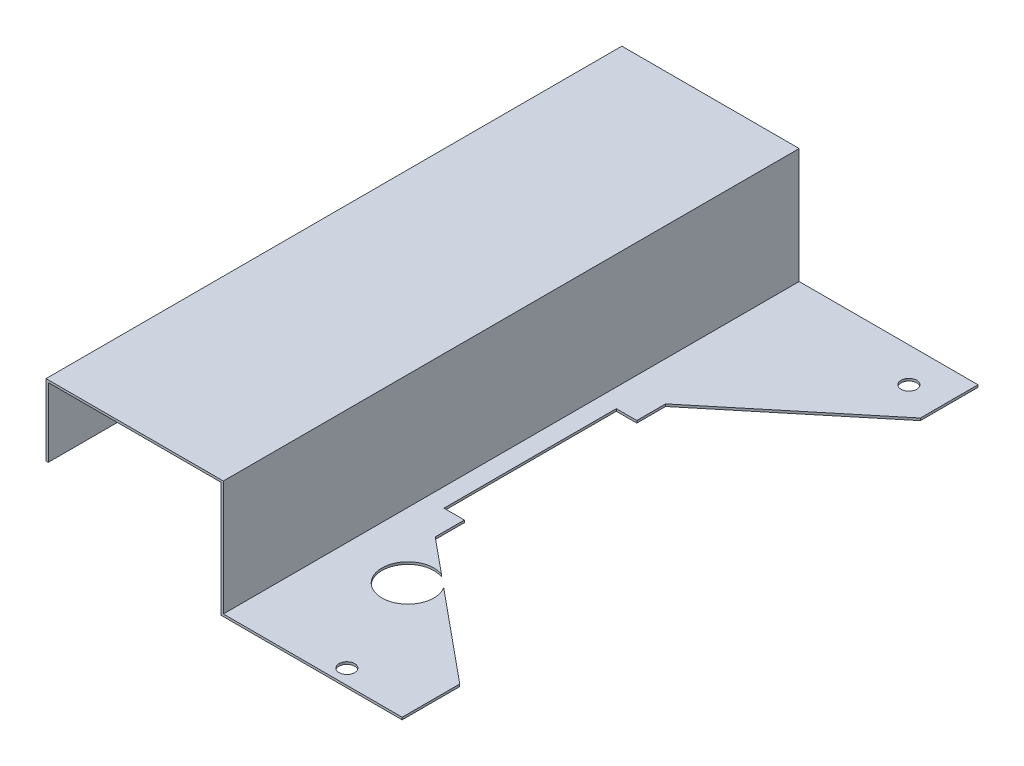
ISO-10303-21;
HEADER;
FILE_DESCRIPTION(('STEP AP214'),'2;1');
FILE_NAME('part.step','',(''),(''),'','','');
FILE_SCHEMA(('AUTOMOTIVE_DESIGN { 1 0 10303 214 1 1 1 1 }'));
ENDSEC;
DATA;
#1=APPLICATION_CONTEXT('core data for automotive mechanical design processes');
#2=APPLICATION_PROTOCOL_DEFINITION('international standard','automotive_design',2000,#1);
#3=PRODUCT_CONTEXT('',#1,'mechanical');
#4=PRODUCT('Part','Part','',(#3));
#5=PRODUCT_RELATED_PRODUCT_CATEGORY('part','',(#4));
#6=PRODUCT_DEFINITION_FORMATION('','',#4);
#7=PRODUCT_DEFINITION_CONTEXT('part definition',#1,'design');
#8=PRODUCT_DEFINITION('design','',#6,#7);
#9=PRODUCT_DEFINITION_SHAPE('','',#8);
#10=(LENGTH_UNIT() NAMED_UNIT(*) SI_UNIT(.MILLI.,.METRE.));
#11=(NAMED_UNIT(*) PLANE_ANGLE_UNIT() SI_UNIT($,.RADIAN.));
#12=(NAMED_UNIT(*) SI_UNIT($,.STERADIAN.) SOLID_ANGLE_UNIT());
#13=UNCERTAINTY_MEASURE_WITH_UNIT(LENGTH_MEASURE(1.E-05),#10,'distance_accuracy_value','');
#14=(GEOMETRIC_REPRESENTATION_CONTEXT(3) GLOBAL_UNCERTAINTY_ASSIGNED_CONTEXT((#13)) GLOBAL_UNIT_ASSIGNED_CONTEXT((#10,
#11,#12)) REPRESENTATION_CONTEXT('',''));
#15=CARTESIAN_POINT('',(0.,0.,0.));
#16=DIRECTION('',(0.,0.,1.));
#17=DIRECTION('',(1.,0.,0.));
#18=AXIS2_PLACEMENT_3D('',#15,#16,#17);
#19=CARTESIAN_POINT('',(79.8180528583146,-2.30000000000052,125.));
#20=DIRECTION('',(-1.,0.,0.));
#21=DIRECTION('',(0.,-1.,0.));
#22=AXIS2_PLACEMENT_3D('',#19,#20,#21);
#23=PLANE('',#22);
#24=DIRECTION('',(0.,-1.,0.));
#25=VECTOR('',#24,1.);
#26=CARTESIAN_POINT('',(79.8180528583146,-2.30000000000052,37.3429873518982));
#27=LINE('',#26,#25);
#28=CARTESIAN_POINT('',(79.8180528583146,-1.30000000000052,37.3429873518982));
#29=VERTEX_POINT('',#28);
#30=CARTESIAN_POINT('',(79.8180528583146,-2.30000000000052,37.3429873518982));
#31=VERTEX_POINT('',#30);
#32=EDGE_CURVE('E183',#29,#31,#27,.T.);
#33=ORIENTED_EDGE('',*,*,#32,.F.);
#34=DIRECTION('',(0.,0.,-1.));
#35=VECTOR('',#34,1.);
#36=CARTESIAN_POINT('',(79.8180528583146,-1.30000000000052,125.));
#37=LINE('',#36,#35);
#38=CARTESIAN_POINT('',(79.8180528583146,-1.30000000000052,50.));
#39=VERTEX_POINT('',#38);
#40=EDGE_CURVE('E315',#39,#29,#37,.T.);
#41=ORIENTED_EDGE('',*,*,#40,.F.);
#42=DIRECTION('',(0.,-1.,0.));
#43=VECTOR('',#42,1.);
#44=CARTESIAN_POINT('',(79.8180528583146,95.1406406117147,50.));
#45=LINE('',#44,#43);
#46=CARTESIAN_POINT('',(79.8180528583146,-2.30000000000052,50.));
#47=VERTEX_POINT('',#46);
#48=EDGE_CURVE('E255',#39,#47,#45,.T.);
#49=ORIENTED_EDGE('',*,*,#48,.T.);
#50=DIRECTION('',(0.,0.,-1.));
#51=VECTOR('',#50,1.);
#52=CARTESIAN_POINT('',(79.8180528583146,-2.30000000000052,125.));
#53=LINE('',#52,#51);
#54=EDGE_CURVE('E318',#47,#31,#53,.T.);
#55=ORIENTED_EDGE('',*,*,#54,.T.);
#56=EDGE_LOOP('',(#33,#41,#49,#55));
#57=FACE_BOUND('',#56,.T.);
#58=ADVANCED_FACE('F37',(#57),#23,.F.);
#59=CARTESIAN_POINT('',(7.7681065171597,95.1406406117147,-9.41935004810131));
#60=DIRECTION('',(-0.636243696362508,0.,0.771488145624399));
#61=DIRECTION('',(0.771488145624399,0.,0.636243696362508));
#62=AXIS2_PLACEMENT_3D('',#59,#60,#61);
#63=PLANE('',#62);
#64=DIRECTION('',(0.771488145624399,0.,0.636243696362508));
#65=VECTOR('',#64,1.);
#66=CARTESIAN_POINT('',(7.7681065171597,-1.30000000000054,-9.4193500481013));
#67=LINE('',#66,#65);
#68=CARTESIAN_POINT('',(95.2648680140729,-1.30000000000052,62.7389368553083));
#69=VERTEX_POINT('',#68);
#70=EDGE_CURVE('E243',#39,#69,#67,.T.);
#71=ORIENTED_EDGE('',*,*,#70,.T.);
#72=DIRECTION('',(0.,-1.,0.));
#73=VECTOR('',#72,1.);
#74=CARTESIAN_POINT('',(95.2648680140729,-1.30000000000052,62.7389368553083));
#75=LINE('',#74,#73);
#76=CARTESIAN_POINT('',(95.2648680140729,-2.30000000000052,62.7389368553083));
#77=VERTEX_POINT('',#76);
#78=EDGE_CURVE('E11',#69,#77,#75,.T.);
#79=ORIENTED_EDGE('',*,*,#78,.T.);
#80=DIRECTION('',(-0.771488145624399,0.,-0.636243696362508));
#81=VECTOR('',#80,1.);
#82=CARTESIAN_POINT('',(7.7681065171597,-2.30000000000052,-9.41935004810131));
#83=LINE('',#82,#81);
#84=EDGE_CURVE('E242',#77,#47,#83,.T.);
#85=ORIENTED_EDGE('',*,*,#84,.T.);
#86=ORIENTED_EDGE('',*,*,#48,.F.);
#87=EDGE_LOOP('',(#71,#79,#85,#86));
#88=FACE_BOUND('',#87,.T.);
#89=ADVANCED_FACE('F353',(#88),#63,.F.);
#90=CARTESIAN_POINT('',(61.8180528583146,-2.30000000000052,125.));
#91=DIRECTION('',(0.,1.,0.));
#92=DIRECTION('',(0.,0.,1.));
#93=AXIS2_PLACEMENT_3D('',#90,#91,#92);
#94=PLANE('',#93);
#95=CARTESIAN_POINT('',(79.8180528583146,-2.30000000000052,-37.4979309496583));
#96=VERTEX_POINT('',#95);
#97=CARTESIAN_POINT('',(79.8180528583146,-2.30000000000052,-50.));
#98=VERTEX_POINT('',#97);
#99=EDGE_CURVE('E317',#96,#98,#53,.T.);
#100=ORIENTED_EDGE('',*,*,#99,.F.);
#101=DIRECTION('',(1.,0.,0.));
#102=VECTOR('',#101,1.);
#103=CARTESIAN_POINT('',(70.918942863643,-2.30000000000052,-37.4979309496583));
#104=LINE('',#103,#102);
#105=CARTESIAN_POINT('',(70.918942863643,-2.30000000000052,-37.4979309496583));
#106=VERTEX_POINT('',#105);
#107=EDGE_CURVE('E200',#106,#96,#104,.T.);
#108=ORIENTED_EDGE('',*,*,#107,.F.);
#109=DIRECTION('',(0.,0.,1.));
#110=VECTOR('',#109,1.);
#111=CARTESIAN_POINT('',(70.918942863643,-2.30000000000052,-37.4979309496583));
#112=LINE('',#111,#110);
#113=CARTESIAN_POINT('',(70.918942863643,-2.30000000000052,37.3429873518982));
#114=VERTEX_POINT('',#113);
#115=EDGE_CURVE('E180',#106,#114,#112,.T.);
#116=ORIENTED_EDGE('',*,*,#115,.T.);
#117=DIRECTION('',(1.,0.,0.));
#118=VECTOR('',#117,1.);
#119=CARTESIAN_POINT('',(70.918942863643,-2.30000000000052,37.3429873518982));
#120=LINE('',#119,#118);
#121=EDGE_CURVE('E202',#114,#31,#120,.T.);
#122=ORIENTED_EDGE('',*,*,#121,.T.);
#123=ORIENTED_EDGE('',*,*,#54,.F.);
#124=ORIENTED_EDGE('',*,*,#84,.F.);
#125=CARTESIAN_POINT('',(91.2232624106757,-2.30000000000052,73.2786514135488));
#126=DIRECTION('',(0.,-1.,0.));
#127=DIRECTION('',(0.,0.,-1.));
#128=AXIS2_PLACEMENT_3D('',#125,#126,#127);
#129=CIRCLE('',#128,11.2880538102278);
#130=CARTESIAN_POINT('',(100.800721531511,-2.30000000000052,67.3043367573448));
#131=VERTEX_POINT('',#130);
#132=EDGE_CURVE('E208',#131,#77,#129,.T.);
#133=ORIENTED_EDGE('',*,*,#132,.F.);
#134=CARTESIAN_POINT('',(140.446405644763,-2.30000000000052,100.));
#135=VERTEX_POINT('',#134);
#136=EDGE_CURVE('E248',#135,#131,#83,.T.);
#137=ORIENTED_EDGE('',*,*,#136,.F.);
#138=DIRECTION('',(0.,0.,-1.));
#139=VECTOR('',#138,1.);
#140=CARTESIAN_POINT('',(140.446405644763,-2.30000000000052,0.));
#141=LINE('',#140,#139);
#142=CARTESIAN_POINT('',(140.446405644763,-2.30000000000052,125.));
#143=VERTEX_POINT('',#142);
#144=EDGE_CURVE('E251',#143,#135,#141,.T.);
#145=ORIENTED_EDGE('',*,*,#144,.F.);
#146=DIRECTION('',(1.,0.,0.));
#147=VECTOR('',#146,1.);
#148=CARTESIAN_POINT('',(61.8180528583146,-2.30000000000052,125.));
#149=LINE('',#148,#147);
#150=CARTESIAN_POINT('',(61.8180528583146,-2.30000000000052,125.));
#151=VERTEX_POINT('',#150);
#152=EDGE_CURVE('E275',#151,#143,#149,.T.);
#153=ORIENTED_EDGE('',*,*,#152,.F.);
#154=DIRECTION('',(0.,0.,-1.));
#155=VECTOR('',#154,1.);
#156=CARTESIAN_POINT('',(61.8180528583146,-2.30000000000052,125.));
#157=LINE('',#156,#155);
#158=CARTESIAN_POINT('',(61.8180528583146,-2.30000000000052,-125.));
#159=VERTEX_POINT('',#158);
#160=EDGE_CURVE('E321',#151,#159,#157,.T.);
#161=ORIENTED_EDGE('',*,*,#160,.T.);
#162=DIRECTION('',(1.,0.,0.));
#163=VECTOR('',#162,1.);
#164=CARTESIAN_POINT('',(61.8180528583146,-2.30000000000052,-125.));
#165=LINE('',#164,#163);
#166=CARTESIAN_POINT('',(140.446405644763,-2.30000000000052,-125.));
#167=VERTEX_POINT('',#166);
#168=EDGE_CURVE('E294',#159,#167,#165,.T.);
#169=ORIENTED_EDGE('',*,*,#168,.T.);
#170=DIRECTION('',(0.,0.,1.));
#171=VECTOR('',#170,1.);
#172=CARTESIAN_POINT('',(140.446405644763,-2.30000000000052,0.));
#173=LINE('',#172,#171);
#174=CARTESIAN_POINT('',(140.446405644763,-2.30000000000052,-100.));
#175=VERTEX_POINT('',#174);
#176=EDGE_CURVE('E223',#167,#175,#173,.T.);
#177=ORIENTED_EDGE('',*,*,#176,.T.);
#178=DIRECTION('',(-0.771488145624399,0.,0.636243696362508));
#179=VECTOR('',#178,1.);
#180=CARTESIAN_POINT('',(7.7681065171597,-2.30000000000052,9.41935004810131));
#181=LINE('',#180,#179);
#182=EDGE_CURVE('E231',#175,#98,#181,.T.);
#183=ORIENTED_EDGE('',*,*,#182,.T.);
#184=EDGE_LOOP('',(#100,#108,#116,#122,#123,#124,#133,#137,#145,#153,#161,#169,#177,#183));
#185=FACE_BOUND('',#184,.T.);
#186=CARTESIAN_POINT('',(109.974750596565,-2.30000000000052,118.548748506602));
#187=DIRECTION('',(0.,-1.,0.));
#188=DIRECTION('',(0.,0.,-1.));
#189=AXIS2_PLACEMENT_3D('',#186,#187,#188);
#190=CIRCLE('',#189,3.4);
#191=CARTESIAN_POINT('',(109.974750596565,-2.30000000000052,115.148748506602));
#192=VERTEX_POINT('',#191);
#193=EDGE_CURVE('E217',#192,#192,#190,.T.);
#194=ORIENTED_EDGE('',*,*,#193,.F.);
#195=EDGE_LOOP('',(#194));
#196=FACE_BOUND('',#195,.T.);
#197=CARTESIAN_POINT('',(125.446405644763,-2.30000000000052,-110.));
#198=DIRECTION('',(0.,-1.,0.));
#199=DIRECTION('',(0.,0.,-1.));
#200=AXIS2_PLACEMENT_3D('',#197,#198,#199);
#201=CIRCLE('',#200,3.39999999999999);
#202=CARTESIAN_POINT('',(125.446405644763,-2.30000000000052,-113.4));
#203=VERTEX_POINT('',#202);
#204=EDGE_CURVE('E210',#203,#203,#201,.T.);
#205=ORIENTED_EDGE('',*,*,#204,.F.);
#206=EDGE_LOOP('',(#205));
#207=FACE_BOUND('',#206,.T.);
#208=ADVANCED_FACE('F347',(#185,#196,#207),#94,.F.);
#209=CARTESIAN_POINT('',(-14.1819471416854,17.6999999999995,125.));
#210=DIRECTION('',(0.,1.,0.));
#211=DIRECTION('',(0.,0.,1.));
#212=AXIS2_PLACEMENT_3D('',#209,#210,#211);
#213=PLANE('',#212);
#214=DIRECTION('',(1.,0.,0.));
#215=VECTOR('',#214,1.);
#216=CARTESIAN_POINT('',(-14.1819471416854,17.6999999999995,-125.));
#217=LINE('',#216,#215);
#218=CARTESIAN_POINT('',(-14.1819471416854,17.6999999999995,-125.));
#219=VERTEX_POINT('',#218);
#220=CARTESIAN_POINT('',(-13.1819471416855,17.6999999999995,-125.));
#221=VERTEX_POINT('',#220);
#222=EDGE_CURVE('E246',#219,#221,#217,.T.);
#223=ORIENTED_EDGE('',*,*,#222,.T.);
#224=DIRECTION('',(0.,0.,-1.));
#225=VECTOR('',#224,1.);
#226=CARTESIAN_POINT('',(-13.1819471416855,17.6999999999995,125.));
#227=LINE('',#226,#225);
#228=CARTESIAN_POINT('',(-13.1819471416855,17.6999999999995,125.));
#229=VERTEX_POINT('',#228);
#230=EDGE_CURVE('E330',#229,#221,#227,.T.);
#231=ORIENTED_EDGE('',*,*,#230,.F.);
#232=DIRECTION('',(1.,0.,0.));
#233=VECTOR('',#232,1.);
#234=CARTESIAN_POINT('',(-14.1819471416854,17.6999999999995,125.));
#235=LINE('',#234,#233);
#236=CARTESIAN_POINT('',(-14.1819471416854,17.6999999999995,125.));
#237=VERTEX_POINT('',#236);
#238=EDGE_CURVE('E265',#237,#229,#235,.T.);
#239=ORIENTED_EDGE('',*,*,#238,.F.);
#240=DIRECTION('',(0.,0.,-1.));
#241=VECTOR('',#240,1.);
#242=CARTESIAN_POINT('',(-14.1819471416854,17.6999999999995,125.));
#243=LINE('',#242,#241);
#244=EDGE_CURVE('E285',#237,#219,#243,.T.);
#245=ORIENTED_EDGE('',*,*,#244,.T.);
#246=EDGE_LOOP('',(#223,#231,#239,#245));
#247=FACE_BOUND('',#246,.T.);
#248=ADVANCED_FACE('F39',(#247),#213,.F.);
#249=CARTESIAN_POINT('',(-13.1819471416855,17.6999999999995,125.));
#250=DIRECTION('',(-1.,0.,0.));
#251=DIRECTION('',(0.,-1.,0.));
#252=AXIS2_PLACEMENT_3D('',#249,#250,#251);
#253=PLANE('',#252);
#254=DIRECTION('',(0.,1.,0.));
#255=VECTOR('',#254,1.);
#256=CARTESIAN_POINT('',(-13.1819471416855,17.6999999999995,-125.));
#257=LINE('',#256,#255);
#258=CARTESIAN_POINT('',(-13.1819471416854,47.6999999999995,-125.));
#259=VERTEX_POINT('',#258);
#260=EDGE_CURVE('E288',#221,#259,#257,.T.);
#261=ORIENTED_EDGE('',*,*,#260,.T.);
#262=DIRECTION('',(0.,0.,-1.));
#263=VECTOR('',#262,1.);
#264=CARTESIAN_POINT('',(-13.1819471416854,47.6999999999995,125.));
#265=LINE('',#264,#263);
#266=CARTESIAN_POINT('',(-13.1819471416854,47.6999999999995,125.));
#267=VERTEX_POINT('',#266);
#268=EDGE_CURVE('E327',#267,#259,#265,.T.);
#269=ORIENTED_EDGE('',*,*,#268,.F.);
#270=DIRECTION('',(0.,1.,0.));
#271=VECTOR('',#270,1.);
#272=CARTESIAN_POINT('',(-13.1819471416855,17.6999999999995,125.));
#273=LINE('',#272,#271);
#274=EDGE_CURVE('E268',#229,#267,#273,.T.);
#275=ORIENTED_EDGE('',*,*,#274,.F.);
#276=ORIENTED_EDGE('',*,*,#230,.T.);
#277=EDGE_LOOP('',(#261,#269,#275,#276));
#278=FACE_BOUND('',#277,.T.);
#279=ADVANCED_FACE('F398',(#278),#253,.F.);
#280=CARTESIAN_POINT('',(-13.1819471416854,47.6999999999995,125.));
#281=DIRECTION('',(0.,1.,0.));
#282=DIRECTION('',(-1.,0.,0.));
#283=AXIS2_PLACEMENT_3D('',#280,#281,#282);
#284=PLANE('',#283);
#285=DIRECTION('',(1.,0.,0.));
#286=VECTOR('',#285,1.);
#287=CARTESIAN_POINT('',(-13.1819471416854,47.6999999999995,-125.));
#288=LINE('',#287,#286);
#289=CARTESIAN_POINT('',(61.8180528583146,47.6999999999995,-125.));
#290=VERTEX_POINT('',#289);
#291=EDGE_CURVE('E290',#259,#290,#288,.T.);
#292=ORIENTED_EDGE('',*,*,#291,.T.);
#293=DIRECTION('',(0.,0.,-1.));
#294=VECTOR('',#293,1.);
#295=CARTESIAN_POINT('',(61.8180528583146,47.6999999999995,125.));
#296=LINE('',#295,#294);
#297=CARTESIAN_POINT('',(61.8180528583146,47.6999999999995,125.));
#298=VERTEX_POINT('',#297);
#299=EDGE_CURVE('E324',#298,#290,#296,.T.);
#300=ORIENTED_EDGE('',*,*,#299,.F.);
#301=DIRECTION('',(1.,0.,0.));
#302=VECTOR('',#301,1.);
#303=CARTESIAN_POINT('',(-13.1819471416854,47.6999999999995,125.));
#304=LINE('',#303,#302);
#305=EDGE_CURVE('E271',#267,#298,#304,.T.);
#306=ORIENTED_EDGE('',*,*,#305,.F.);
#307=ORIENTED_EDGE('',*,*,#268,.T.);
#308=EDGE_LOOP('',(#292,#300,#306,#307));
#309=FACE_BOUND('',#308,.T.);
#310=ADVANCED_FACE('F395',(#309),#284,.F.);
#311=CARTESIAN_POINT('',(61.8180528583146,47.6999999999995,125.));
#312=DIRECTION('',(1.,0.,0.));
#313=DIRECTION('',(0.,1.,0.));
#314=AXIS2_PLACEMENT_3D('',#311,#312,#313);
#315=PLANE('',#314);
#316=DIRECTION('',(0.,-1.,0.));
#317=VECTOR('',#316,1.);
#318=CARTESIAN_POINT('',(61.8180528583146,47.6999999999995,-125.));
#319=LINE('',#318,#317);
#320=EDGE_CURVE('E292',#290,#159,#319,.T.);
#321=ORIENTED_EDGE('',*,*,#320,.T.);
#322=ORIENTED_EDGE('',*,*,#160,.F.);
#323=DIRECTION('',(0.,-1.,0.));
#324=VECTOR('',#323,1.);
#325=CARTESIAN_POINT('',(61.8180528583146,47.6999999999995,125.));
#326=LINE('',#325,#324);
#327=EDGE_CURVE('E273',#298,#151,#326,.T.);
#328=ORIENTED_EDGE('',*,*,#327,.F.);
#329=ORIENTED_EDGE('',*,*,#299,.T.);
#330=EDGE_LOOP('',(#321,#322,#328,#329));
#331=FACE_BOUND('',#330,.T.);
#332=ADVANCED_FACE('F392',(#331),#315,.F.);
#333=CARTESIAN_POINT('',(79.8180528583146,-1.30000000000052,-37.4979309496583));
#334=VERTEX_POINT('',#333);
#335=CARTESIAN_POINT('',(79.8180528583146,-1.30000000000052,-50.));
#336=VERTEX_POINT('',#335);
#337=EDGE_CURVE('E314',#334,#336,#37,.T.);
#338=ORIENTED_EDGE('',*,*,#337,.F.);
#339=DIRECTION('',(0.,-1.,0.));
#340=VECTOR('',#339,1.);
#341=CARTESIAN_POINT('',(79.8180528583146,-2.30000000000052,-37.4979309496583));
#342=LINE('',#341,#340);
#343=EDGE_CURVE('E189',#334,#96,#342,.T.);
#344=ORIENTED_EDGE('',*,*,#343,.T.);
#345=ORIENTED_EDGE('',*,*,#99,.T.);
#346=DIRECTION('',(0.,-1.,0.));
#347=VECTOR('',#346,1.);
#348=CARTESIAN_POINT('',(79.8180528583146,95.1406406117147,-50.));
#349=LINE('',#348,#347);
#350=EDGE_CURVE('E237',#336,#98,#349,.T.);
#351=ORIENTED_EDGE('',*,*,#350,.F.);
#352=EDGE_LOOP('',(#338,#344,#345,#351));
#353=FACE_BOUND('',#352,.T.);
#354=ADVANCED_FACE('F360',(#353),#23,.F.);
#355=CARTESIAN_POINT('',(79.8180528583146,-1.30000000000052,125.));
#356=DIRECTION('',(0.,-1.,0.));
#357=DIRECTION('',(1.,0.,0.));
#358=AXIS2_PLACEMENT_3D('',#355,#356,#357);
#359=PLANE('',#358);
#360=CARTESIAN_POINT('',(125.446405644763,-1.30000000000052,-110.));
#361=DIRECTION('',(0.,-1.,0.));
#362=DIRECTION('',(1.,0.,0.));
#363=AXIS2_PLACEMENT_3D('',#360,#361,#362);
#364=CIRCLE('',#363,3.39999999999999);
#365=CARTESIAN_POINT('',(128.846405644763,-1.30000000000052,-110.));
#366=VERTEX_POINT('',#365);
#367=EDGE_CURVE('E214',#366,#366,#364,.T.);
#368=ORIENTED_EDGE('',*,*,#367,.T.);
#369=EDGE_LOOP('',(#368));
#370=FACE_BOUND('',#369,.T.);
#371=CARTESIAN_POINT('',(109.974750596565,-1.30000000000052,118.548748506602));
#372=DIRECTION('',(0.,-1.,0.));
#373=DIRECTION('',(1.,0.,0.));
#374=AXIS2_PLACEMENT_3D('',#371,#372,#373);
#375=CIRCLE('',#374,3.39999999999999);
#376=CARTESIAN_POINT('',(113.374750596565,-1.30000000000052,118.548748506602));
#377=VERTEX_POINT('',#376);
#378=EDGE_CURVE('E220',#377,#377,#375,.T.);
#379=ORIENTED_EDGE('',*,*,#378,.T.);
#380=EDGE_LOOP('',(#379));
#381=FACE_BOUND('',#380,.T.);
#382=DIRECTION('',(0.,0.,1.));
#383=VECTOR('',#382,1.);
#384=CARTESIAN_POINT('',(70.918942863643,-1.30000000000052,-37.4979309496583));
#385=LINE('',#384,#383);
#386=CARTESIAN_POINT('',(70.918942863643,-1.30000000000052,-37.4979309496583));
#387=VERTEX_POINT('',#386);
#388=CARTESIAN_POINT('',(70.918942863643,-1.30000000000052,37.3429873518982));
#389=VERTEX_POINT('',#388);
#390=EDGE_CURVE('E177',#387,#389,#385,.T.);
#391=ORIENTED_EDGE('',*,*,#390,.F.);
#392=DIRECTION('',(1.,0.,0.));
#393=VECTOR('',#392,1.);
#394=CARTESIAN_POINT('',(70.918942863643,-1.30000000000052,-37.4979309496583));
#395=LINE('',#394,#393);
#396=EDGE_CURVE('E186',#387,#334,#395,.T.);
#397=ORIENTED_EDGE('',*,*,#396,.T.);
#398=ORIENTED_EDGE('',*,*,#337,.T.);
#399=DIRECTION('',(0.771488145624399,0.,-0.636243696362508));
#400=VECTOR('',#399,1.);
#401=CARTESIAN_POINT('',(7.7681065171597,-1.30000000000054,9.4193500481013));
#402=LINE('',#401,#400);
#403=CARTESIAN_POINT('',(140.446405644763,-1.30000000000052,-100.));
#404=VERTEX_POINT('',#403);
#405=EDGE_CURVE('E227',#336,#404,#402,.T.);
#406=ORIENTED_EDGE('',*,*,#405,.T.);
#407=DIRECTION('',(0.,0.,-1.));
#408=VECTOR('',#407,1.);
#409=CARTESIAN_POINT('',(140.446405644763,-1.30000000000051,0.));
#410=LINE('',#409,#408);
#411=CARTESIAN_POINT('',(140.446405644763,-1.30000000000052,-125.));
#412=VERTEX_POINT('',#411);
#413=EDGE_CURVE('E224',#404,#412,#410,.T.);
#414=ORIENTED_EDGE('',*,*,#413,.T.);
#415=DIRECTION('',(-1.,0.,0.));
#416=VECTOR('',#415,1.);
#417=CARTESIAN_POINT('',(79.8180528583146,-1.30000000000052,-125.));
#418=LINE('',#417,#416);
#419=CARTESIAN_POINT('',(62.8180528583146,-1.30000000000053,-125.));
#420=VERTEX_POINT('',#419);
#421=EDGE_CURVE('E296',#412,#420,#418,.T.);
#422=ORIENTED_EDGE('',*,*,#421,.T.);
#423=DIRECTION('',(0.,0.,-1.));
#424=VECTOR('',#423,1.);
#425=CARTESIAN_POINT('',(62.8180528583146,-1.30000000000053,125.));
#426=LINE('',#425,#424);
#427=CARTESIAN_POINT('',(62.8180528583146,-1.30000000000053,125.));
#428=VERTEX_POINT('',#427);
#429=EDGE_CURVE('E311',#428,#420,#426,.T.);
#430=ORIENTED_EDGE('',*,*,#429,.F.);
#431=DIRECTION('',(-1.,0.,0.));
#432=VECTOR('',#431,1.);
#433=CARTESIAN_POINT('',(79.8180528583146,-1.30000000000052,125.));
#434=LINE('',#433,#432);
#435=CARTESIAN_POINT('',(140.446405644763,-1.30000000000051,125.));
#436=VERTEX_POINT('',#435);
#437=EDGE_CURVE('E277',#436,#428,#434,.T.);
#438=ORIENTED_EDGE('',*,*,#437,.F.);
#439=DIRECTION('',(0.,0.,1.));
#440=VECTOR('',#439,1.);
#441=CARTESIAN_POINT('',(140.446405644763,-1.30000000000051,0.));
#442=LINE('',#441,#440);
#443=CARTESIAN_POINT('',(140.446405644763,-1.30000000000051,100.));
#444=VERTEX_POINT('',#443);
#445=EDGE_CURVE('E258',#444,#436,#442,.T.);
#446=ORIENTED_EDGE('',*,*,#445,.F.);
#447=CARTESIAN_POINT('',(100.800721531511,-1.30000000000052,67.3043367573448));
#448=VERTEX_POINT('',#447);
#449=EDGE_CURVE('E247',#448,#444,#67,.T.);
#450=ORIENTED_EDGE('',*,*,#449,.F.);
#451=CARTESIAN_POINT('',(91.2232624106757,-1.30000000000052,73.2786514135488));
#452=DIRECTION('',(0.,-1.,0.));
#453=DIRECTION('',(0.,0.,-1.));
#454=AXIS2_PLACEMENT_3D('',#451,#452,#453);
#455=CIRCLE('',#454,11.2880538102278);
#456=EDGE_CURVE('E60',#448,#69,#455,.T.);
#457=ORIENTED_EDGE('',*,*,#456,.T.);
#458=ORIENTED_EDGE('',*,*,#70,.F.);
#459=ORIENTED_EDGE('',*,*,#40,.T.);
#460=DIRECTION('',(1.,0.,0.));
#461=VECTOR('',#460,1.);
#462=CARTESIAN_POINT('',(70.918942863643,-1.30000000000052,37.3429873518982));
#463=LINE('',#462,#461);
#464=EDGE_CURVE('E192',#389,#29,#463,.T.);
#465=ORIENTED_EDGE('',*,*,#464,.F.);
#466=EDGE_LOOP('',(#391,#397,#398,#406,#414,#422,#430,#438,#446,#450,#457,#458,#459,#465));
#467=FACE_BOUND('',#466,.T.);
#468=ADVANCED_FACE('F194',(#370,#381,#467),#359,.F.);
#469=CARTESIAN_POINT('',(62.8180528583146,-1.30000000000053,125.));
#470=DIRECTION('',(-1.,0.,0.));
#471=DIRECTION('',(0.,0.,1.));
#472=AXIS2_PLACEMENT_3D('',#469,#470,#471);
#473=PLANE('',#472);
#474=DIRECTION('',(0.,1.,0.));
#475=VECTOR('',#474,1.);
#476=CARTESIAN_POINT('',(62.8180528583146,-1.30000000000053,-125.));
#477=LINE('',#476,#475);
#478=CARTESIAN_POINT('',(62.8180528583146,48.6999999999995,-125.));
#479=VERTEX_POINT('',#478);
#480=EDGE_CURVE('E298',#420,#479,#477,.T.);
#481=ORIENTED_EDGE('',*,*,#480,.T.);
#482=DIRECTION('',(0.,0.,-1.));
#483=VECTOR('',#482,1.);
#484=CARTESIAN_POINT('',(62.8180528583146,48.6999999999995,125.));
#485=LINE('',#484,#483);
#486=CARTESIAN_POINT('',(62.8180528583146,48.6999999999995,125.));
#487=VERTEX_POINT('',#486);
#488=EDGE_CURVE('E308',#487,#479,#485,.T.);
#489=ORIENTED_EDGE('',*,*,#488,.F.);
#490=DIRECTION('',(0.,1.,0.));
#491=VECTOR('',#490,1.);
#492=CARTESIAN_POINT('',(62.8180528583146,-1.30000000000053,125.));
#493=LINE('',#492,#491);
#494=EDGE_CURVE('E279',#428,#487,#493,.T.);
#495=ORIENTED_EDGE('',*,*,#494,.F.);
#496=ORIENTED_EDGE('',*,*,#429,.T.);
#497=EDGE_LOOP('',(#481,#489,#495,#496));
#498=FACE_BOUND('',#497,.T.);
#499=ADVANCED_FACE('F382',(#498),#473,.F.);
#500=CARTESIAN_POINT('',(62.8180528583146,48.6999999999995,125.));
#501=DIRECTION('',(0.,-1.,0.));
#502=DIRECTION('',(1.,0.,0.));
#503=AXIS2_PLACEMENT_3D('',#500,#501,#502);
#504=PLANE('',#503);
#505=DIRECTION('',(-1.,0.,0.));
#506=VECTOR('',#505,1.);
#507=CARTESIAN_POINT('',(62.8180528583146,48.6999999999995,-125.));
#508=LINE('',#507,#506);
#509=CARTESIAN_POINT('',(-14.1819471416855,48.6999999999995,-125.));
#510=VERTEX_POINT('',#509);
#511=EDGE_CURVE('E300',#479,#510,#508,.T.);
#512=ORIENTED_EDGE('',*,*,#511,.T.);
#513=DIRECTION('',(0.,0.,-1.));
#514=VECTOR('',#513,1.);
#515=CARTESIAN_POINT('',(-14.1819471416855,48.6999999999995,125.));
#516=LINE('',#515,#514);
#517=CARTESIAN_POINT('',(-14.1819471416855,48.6999999999995,125.));
#518=VERTEX_POINT('',#517);
#519=EDGE_CURVE('E305',#518,#510,#516,.T.);
#520=ORIENTED_EDGE('',*,*,#519,.F.);
#521=DIRECTION('',(-1.,0.,0.));
#522=VECTOR('',#521,1.);
#523=CARTESIAN_POINT('',(62.8180528583146,48.6999999999995,125.));
#524=LINE('',#523,#522);
#525=EDGE_CURVE('E281',#487,#518,#524,.T.);
#526=ORIENTED_EDGE('',*,*,#525,.F.);
#527=ORIENTED_EDGE('',*,*,#488,.T.);
#528=EDGE_LOOP('',(#512,#520,#526,#527));
#529=FACE_BOUND('',#528,.T.);
#530=ADVANCED_FACE('F408',(#529),#504,.F.);
#531=CARTESIAN_POINT('',(-14.1819471416855,48.6999999999995,125.));
#532=DIRECTION('',(1.,0.,0.));
#533=DIRECTION('',(0.,1.,0.));
#534=AXIS2_PLACEMENT_3D('',#531,#532,#533);
#535=PLANE('',#534);
#536=DIRECTION('',(0.,-1.,0.));
#537=VECTOR('',#536,1.);
#538=CARTESIAN_POINT('',(-14.1819471416855,48.6999999999995,-125.));
#539=LINE('',#538,#537);
#540=EDGE_CURVE('E269',#510,#219,#539,.T.);
#541=ORIENTED_EDGE('',*,*,#540,.T.);
#542=ORIENTED_EDGE('',*,*,#244,.F.);
#543=DIRECTION('',(0.,-1.,0.));
#544=VECTOR('',#543,1.);
#545=CARTESIAN_POINT('',(-14.1819471416855,48.6999999999995,125.));
#546=LINE('',#545,#544);
#547=EDGE_CURVE('E283',#518,#237,#546,.T.);
#548=ORIENTED_EDGE('',*,*,#547,.F.);
#549=ORIENTED_EDGE('',*,*,#519,.T.);
#550=EDGE_LOOP('',(#541,#542,#548,#549));
#551=FACE_BOUND('',#550,.T.);
#552=ADVANCED_FACE('F405',(#551),#535,.F.);
#553=CARTESIAN_POINT('',(0.,0.,125.));
#554=DIRECTION('',(0.,0.,1.));
#555=DIRECTION('',(1.,0.,0.));
#556=AXIS2_PLACEMENT_3D('',#553,#554,#555);
#557=PLANE('',#556);
#558=ORIENTED_EDGE('',*,*,#238,.T.);
#559=ORIENTED_EDGE('',*,*,#274,.T.);
#560=ORIENTED_EDGE('',*,*,#305,.T.);
#561=ORIENTED_EDGE('',*,*,#327,.T.);
#562=ORIENTED_EDGE('',*,*,#152,.T.);
#563=DIRECTION('',(0.,-1.,0.));
#564=VECTOR('',#563,1.);
#565=CARTESIAN_POINT('',(140.446405644763,95.1406406117147,125.));
#566=LINE('',#565,#564);
#567=EDGE_CURVE('E259',#436,#143,#566,.T.);
#568=ORIENTED_EDGE('',*,*,#567,.F.);
#569=ORIENTED_EDGE('',*,*,#437,.T.);
#570=ORIENTED_EDGE('',*,*,#494,.T.);
#571=ORIENTED_EDGE('',*,*,#525,.T.);
#572=ORIENTED_EDGE('',*,*,#547,.T.);
#573=EDGE_LOOP('',(#558,#559,#560,#561,#562,#568,#569,#570,#571,#572));
#574=FACE_BOUND('',#573,.T.);
#575=ADVANCED_FACE('F386',(#574),#557,.T.);
#576=CARTESIAN_POINT('',(0.,0.,-125.));
#577=DIRECTION('',(0.,0.,1.));
#578=DIRECTION('',(1.,0.,0.));
#579=AXIS2_PLACEMENT_3D('',#576,#577,#578);
#580=PLANE('',#579);
#581=ORIENTED_EDGE('',*,*,#222,.F.);
#582=ORIENTED_EDGE('',*,*,#540,.F.);
#583=ORIENTED_EDGE('',*,*,#511,.F.);
#584=ORIENTED_EDGE('',*,*,#480,.F.);
#585=ORIENTED_EDGE('',*,*,#421,.F.);
#586=DIRECTION('',(0.,-1.,0.));
#587=VECTOR('',#586,1.);
#588=CARTESIAN_POINT('',(140.446405644763,95.1406406117147,-125.));
#589=LINE('',#588,#587);
#590=EDGE_CURVE('E228',#412,#167,#589,.T.);
#591=ORIENTED_EDGE('',*,*,#590,.T.);
#592=ORIENTED_EDGE('',*,*,#168,.F.);
#593=ORIENTED_EDGE('',*,*,#320,.F.);
#594=ORIENTED_EDGE('',*,*,#291,.F.);
#595=ORIENTED_EDGE('',*,*,#260,.F.);
#596=EDGE_LOOP('',(#581,#582,#583,#584,#585,#591,#592,#593,#594,#595));
#597=FACE_BOUND('',#596,.T.);
#598=ADVANCED_FACE('F377',(#597),#580,.F.);
#599=CARTESIAN_POINT('',(140.446405644763,95.1406406117147,0.));
#600=DIRECTION('',(-1.,0.,0.));
#601=DIRECTION('',(0.,0.,1.));
#602=AXIS2_PLACEMENT_3D('',#599,#600,#601);
#603=PLANE('',#602);
#604=DIRECTION('',(0.,-1.,0.));
#605=VECTOR('',#604,1.);
#606=CARTESIAN_POINT('',(140.446405644763,95.1406406117147,100.));
#607=LINE('',#606,#605);
#608=EDGE_CURVE('E254',#444,#135,#607,.T.);
#609=ORIENTED_EDGE('',*,*,#608,.F.);
#610=ORIENTED_EDGE('',*,*,#445,.T.);
#611=ORIENTED_EDGE('',*,*,#567,.T.);
#612=ORIENTED_EDGE('',*,*,#144,.T.);
#613=EDGE_LOOP('',(#609,#610,#611,#612));
#614=FACE_BOUND('',#613,.T.);
#615=ADVANCED_FACE('F342',(#614),#603,.F.);
#616=ORIENTED_EDGE('',*,*,#136,.T.);
#617=DIRECTION('',(0.,-1.,0.));
#618=VECTOR('',#617,1.);
#619=CARTESIAN_POINT('',(100.800721531511,-1.30000000000052,67.3043367573448));
#620=LINE('',#619,#618);
#621=EDGE_CURVE('E45',#131,#448,#620,.F.);
#622=ORIENTED_EDGE('',*,*,#621,.T.);
#623=ORIENTED_EDGE('',*,*,#449,.T.);
#624=ORIENTED_EDGE('',*,*,#608,.T.);
#625=EDGE_LOOP('',(#616,#622,#623,#624));
#626=FACE_BOUND('',#625,.T.);
#627=ADVANCED_FACE('F334',(#626),#63,.F.);
#628=CARTESIAN_POINT('',(140.446405644763,95.1406406117147,0.));
#629=DIRECTION('',(1.,0.,0.));
#630=DIRECTION('',(0.,0.,-1.));
#631=AXIS2_PLACEMENT_3D('',#628,#629,#630);
#632=PLANE('',#631);
#633=ORIENTED_EDGE('',*,*,#413,.F.);
#634=DIRECTION('',(0.,-1.,0.));
#635=VECTOR('',#634,1.);
#636=CARTESIAN_POINT('',(140.446405644763,95.1406406117147,-100.));
#637=LINE('',#636,#635);
#638=EDGE_CURVE('E234',#404,#175,#637,.T.);
#639=ORIENTED_EDGE('',*,*,#638,.T.);
#640=ORIENTED_EDGE('',*,*,#176,.F.);
#641=ORIENTED_EDGE('',*,*,#590,.F.);
#642=EDGE_LOOP('',(#633,#639,#640,#641));
#643=FACE_BOUND('',#642,.T.);
#644=ADVANCED_FACE('F368',(#643),#632,.T.);
#645=CARTESIAN_POINT('',(7.7681065171597,95.1406406117147,9.41935004810131));
#646=DIRECTION('',(0.636243696362508,0.,0.771488145624399));
#647=DIRECTION('',(0.771488145624399,0.,-0.636243696362508));
#648=AXIS2_PLACEMENT_3D('',#645,#646,#647);
#649=PLANE('',#648);
#650=ORIENTED_EDGE('',*,*,#405,.F.);
#651=ORIENTED_EDGE('',*,*,#350,.T.);
#652=ORIENTED_EDGE('',*,*,#182,.F.);
#653=ORIENTED_EDGE('',*,*,#638,.F.);
#654=EDGE_LOOP('',(#650,#651,#652,#653));
#655=FACE_BOUND('',#654,.T.);
#656=ADVANCED_FACE('F371',(#655),#649,.T.);
#657=CARTESIAN_POINT('',(109.974750596565,-2.30000000000052,118.548748506602));
#658=DIRECTION('',(0.,-1.,0.));
#659=DIRECTION('',(0.,0.,-1.));
#660=AXIS2_PLACEMENT_3D('',#657,#658,#659);
#661=CYLINDRICAL_SURFACE('',#660,3.39999999999999);
#662=ORIENTED_EDGE('',*,*,#193,.T.);
#663=EDGE_LOOP('',(#662));
#664=FACE_BOUND('',#663,.T.);
#665=ORIENTED_EDGE('',*,*,#378,.F.);
#666=EDGE_LOOP('',(#665));
#667=FACE_BOUND('',#666,.T.);
#668=ADVANCED_FACE('F509',(#664,#667),#661,.F.);
#669=CARTESIAN_POINT('',(125.446405644763,-2.30000000000052,-110.));
#670=DIRECTION('',(0.,-1.,0.));
#671=DIRECTION('',(0.,0.,-1.));
#672=AXIS2_PLACEMENT_3D('',#669,#670,#671);
#673=CYLINDRICAL_SURFACE('',#672,3.39999999999999);
#674=ORIENTED_EDGE('',*,*,#204,.T.);
#675=EDGE_LOOP('',(#674));
#676=FACE_BOUND('',#675,.T.);
#677=ORIENTED_EDGE('',*,*,#367,.F.);
#678=EDGE_LOOP('',(#677));
#679=FACE_BOUND('',#678,.T.);
#680=ADVANCED_FACE('F457',(#676,#679),#673,.F.);
#681=CARTESIAN_POINT('',(91.2232624106757,-1.30000000000052,73.2786514135488));
#682=DIRECTION('',(0.,-1.,0.));
#683=DIRECTION('',(0.,0.,-1.));
#684=AXIS2_PLACEMENT_3D('',#681,#682,#683);
#685=CYLINDRICAL_SURFACE('',#684,11.2880538102278);
#686=ORIENTED_EDGE('',*,*,#456,.F.);
#687=ORIENTED_EDGE('',*,*,#621,.F.);
#688=ORIENTED_EDGE('',*,*,#132,.T.);
#689=ORIENTED_EDGE('',*,*,#78,.F.);
#690=EDGE_LOOP('',(#686,#687,#688,#689));
#691=FACE_BOUND('',#690,.T.);
#692=ADVANCED_FACE('F351',(#691),#685,.F.);
#693=CARTESIAN_POINT('',(70.918942863643,-1.30000000000052,-37.4979309496583));
#694=DIRECTION('',(0.,0.,-1.));
#695=DIRECTION('',(-1.,0.,0.));
#696=AXIS2_PLACEMENT_3D('',#693,#694,#695);
#697=PLANE('',#696);
#698=ORIENTED_EDGE('',*,*,#396,.F.);
#699=DIRECTION('',(0.,-1.,0.));
#700=VECTOR('',#699,1.);
#701=CARTESIAN_POINT('',(70.918942863643,-1.30000000000052,-37.4979309496583));
#702=LINE('',#701,#700);
#703=EDGE_CURVE('E173',#387,#106,#702,.T.);
#704=ORIENTED_EDGE('',*,*,#703,.T.);
#705=ORIENTED_EDGE('',*,*,#107,.T.);
#706=ORIENTED_EDGE('',*,*,#343,.F.);
#707=EDGE_LOOP('',(#698,#704,#705,#706));
#708=FACE_BOUND('',#707,.T.);
#709=ADVANCED_FACE('F187',(#708),#697,.F.);
#710=CARTESIAN_POINT('',(70.918942863643,-1.30000000000052,37.3429873518982));
#711=DIRECTION('',(0.,0.,-1.));
#712=DIRECTION('',(-1.,0.,0.));
#713=AXIS2_PLACEMENT_3D('',#710,#711,#712);
#714=PLANE('',#713);
#715=ORIENTED_EDGE('',*,*,#32,.T.);
#716=ORIENTED_EDGE('',*,*,#121,.F.);
#717=DIRECTION('',(0.,-1.,0.));
#718=VECTOR('',#717,1.);
#719=CARTESIAN_POINT('',(70.918942863643,-1.30000000000052,37.3429873518982));
#720=LINE('',#719,#718);
#721=EDGE_CURVE('E52',#389,#114,#720,.T.);
#722=ORIENTED_EDGE('',*,*,#721,.F.);
#723=ORIENTED_EDGE('',*,*,#464,.T.);
#724=EDGE_LOOP('',(#715,#716,#722,#723));
#725=FACE_BOUND('',#724,.T.);
#726=ADVANCED_FACE('F358',(#725),#714,.T.);
#727=CARTESIAN_POINT('',(70.918942863643,-1.30000000000052,-37.4979309496583));
#728=DIRECTION('',(1.,0.,0.));
#729=DIRECTION('',(0.,0.,-1.));
#730=AXIS2_PLACEMENT_3D('',#727,#728,#729);
#731=PLANE('',#730);
#732=ORIENTED_EDGE('',*,*,#115,.F.);
#733=ORIENTED_EDGE('',*,*,#703,.F.);
#734=ORIENTED_EDGE('',*,*,#390,.T.);
#735=ORIENTED_EDGE('',*,*,#721,.T.);
#736=EDGE_LOOP('',(#732,#733,#734,#735));
#737=FACE_BOUND('',#736,.T.);
#738=ADVANCED_FACE('F175',(#737),#731,.T.);
#739=CLOSED_SHELL('',(#58,#89,#208,#248,#279,#310,#332,#354,#468,#499,#530,#552,#575,#598,#615,
#627,#644,#656,#668,#680,#692,#709,#726,#738));
#740=MANIFOLD_SOLID_BREP('B2',#739);
#741=ADVANCED_BREP_SHAPE_REPRESENTATION('',(#18,#740),#14);
#742=SHAPE_DEFINITION_REPRESENTATION(#9,#741);
ENDSEC;
END-ISO-10303-21;
